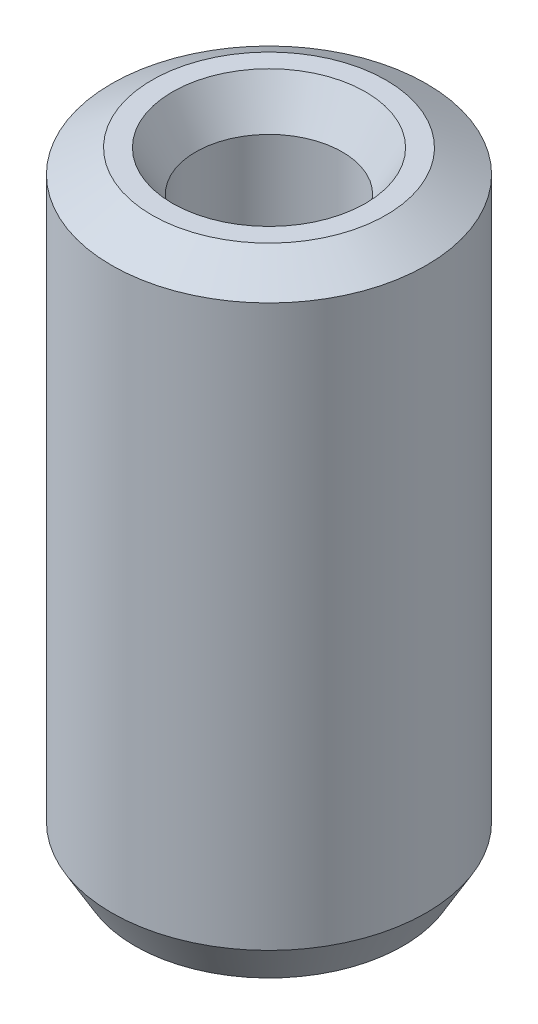
ISO-10303-21;
HEADER;
FILE_DESCRIPTION(('STEP AP214'),'2;1');
FILE_NAME('part.step','',(''),(''),'','','');
FILE_SCHEMA(('AUTOMOTIVE_DESIGN { 1 0 10303 214 1 1 1 1 }'));
ENDSEC;
DATA;
#1=APPLICATION_CONTEXT('core data for automotive mechanical design processes');
#2=APPLICATION_PROTOCOL_DEFINITION('international standard','automotive_design',2000,#1);
#3=PRODUCT_CONTEXT('',#1,'mechanical');
#4=PRODUCT('Part','Part','',(#3));
#5=PRODUCT_RELATED_PRODUCT_CATEGORY('part','',(#4));
#6=PRODUCT_DEFINITION_FORMATION('','',#4);
#7=PRODUCT_DEFINITION_CONTEXT('part definition',#1,'design');
#8=PRODUCT_DEFINITION('design','',#6,#7);
#9=PRODUCT_DEFINITION_SHAPE('','',#8);
#10=(LENGTH_UNIT() NAMED_UNIT(*) SI_UNIT(.MILLI.,.METRE.));
#11=(NAMED_UNIT(*) PLANE_ANGLE_UNIT() SI_UNIT($,.RADIAN.));
#12=(NAMED_UNIT(*) SI_UNIT($,.STERADIAN.) SOLID_ANGLE_UNIT());
#13=UNCERTAINTY_MEASURE_WITH_UNIT(LENGTH_MEASURE(1.E-05),#10,'distance_accuracy_value','');
#14=(GEOMETRIC_REPRESENTATION_CONTEXT(3) GLOBAL_UNCERTAINTY_ASSIGNED_CONTEXT((#13)) GLOBAL_UNIT_ASSIGNED_CONTEXT((#10,
#11,#12)) REPRESENTATION_CONTEXT('',''));
#15=CARTESIAN_POINT('',(0.,0.,0.));
#16=DIRECTION('',(0.,0.,1.));
#17=DIRECTION('',(1.,0.,0.));
#18=AXIS2_PLACEMENT_3D('',#15,#16,#17);
#19=CARTESIAN_POINT('',(0.,19.8357266304487,0.));
#20=DIRECTION('',(0.,-1.,0.));
#21=DIRECTION('',(0.,0.,-1.));
#22=AXIS2_PLACEMENT_3D('',#19,#20,#21);
#23=CYLINDRICAL_SURFACE('',#22,5.);
#24=CARTESIAN_POINT('',(0.,1.28205387955966,0.));
#25=DIRECTION('',(0.,1.,0.));
#26=DIRECTION('',(0.,0.,1.));
#27=AXIS2_PLACEMENT_3D('',#24,#25,#26);
#28=CIRCLE('',#27,5.);
#29=CARTESIAN_POINT('',(0.,1.28205387955966,5.));
#30=VERTEX_POINT('',#29);
#31=EDGE_CURVE('E10',#30,#30,#28,.T.);
#32=ORIENTED_EDGE('',*,*,#31,.T.);
#33=EDGE_LOOP('',(#32));
#34=FACE_BOUND('',#33,.T.);
#35=CARTESIAN_POINT('',(0.,19.0955324779693,0.));
#36=DIRECTION('',(0.,1.,0.));
#37=DIRECTION('',(0.,0.,1.));
#38=AXIS2_PLACEMENT_3D('',#35,#36,#37);
#39=CIRCLE('',#38,5.);
#40=CARTESIAN_POINT('',(0.,19.0955324779693,5.));
#41=VERTEX_POINT('',#40);
#42=EDGE_CURVE('E50',#41,#41,#39,.F.);
#43=ORIENTED_EDGE('',*,*,#42,.T.);
#44=EDGE_LOOP('',(#43));
#45=FACE_BOUND('',#44,.T.);
#46=ADVANCED_FACE('F39',(#34,#45),#23,.T.);
#47=CARTESIAN_POINT('',(0.,19.8357266304487,0.));
#48=DIRECTION('',(0.,1.,0.));
#49=DIRECTION('',(0.,0.,1.));
#50=AXIS2_PLACEMENT_3D('',#47,#48,#49);
#51=PLANE('',#50);
#52=CARTESIAN_POINT('',(0.,19.8357266304487,0.));
#53=DIRECTION('',(0.,1.,0.));
#54=DIRECTION('',(0.,0.,1.));
#55=AXIS2_PLACEMENT_3D('',#52,#53,#54);
#56=CIRCLE('',#55,3.0685033897795);
#57=CARTESIAN_POINT('',(0.,19.8357266304487,3.0685033897795));
#58=VERTEX_POINT('',#57);
#59=EDGE_CURVE('E58',#58,#58,#56,.F.);
#60=ORIENTED_EDGE('',*,*,#59,.T.);
#61=EDGE_LOOP('',(#60));
#62=FACE_BOUND('',#61,.T.);
#63=CARTESIAN_POINT('',(0.,19.8357266304487,0.));
#64=DIRECTION('',(0.,1.,0.));
#65=DIRECTION('',(0.,0.,1.));
#66=AXIS2_PLACEMENT_3D('',#63,#64,#65);
#67=CIRCLE('',#66,3.71794612044034);
#68=CARTESIAN_POINT('',(0.,19.8357266304487,3.71794612044034));
#69=VERTEX_POINT('',#68);
#70=EDGE_CURVE('E61',#69,#69,#67,.T.);
#71=ORIENTED_EDGE('',*,*,#70,.T.);
#72=EDGE_LOOP('',(#71));
#73=FACE_BOUND('',#72,.T.);
#74=ADVANCED_FACE('F88',(#62,#73),#51,.T.);
#75=CARTESIAN_POINT('',(0.,0.,0.));
#76=DIRECTION('',(0.,1.,0.));
#77=DIRECTION('',(0.,0.,1.));
#78=AXIS2_PLACEMENT_3D('',#75,#76,#77);
#79=PLANE('',#78);
#80=CARTESIAN_POINT('',(0.,0.,0.));
#81=DIRECTION('',(0.,1.,0.));
#82=DIRECTION('',(0.,0.,1.));
#83=AXIS2_PLACEMENT_3D('',#80,#81,#82);
#84=CIRCLE('',#83,3.61036311685977);
#85=CARTESIAN_POINT('',(0.,0.,3.61036311685977));
#86=VERTEX_POINT('',#85);
#87=EDGE_CURVE('E51',#86,#86,#84,.T.);
#88=ORIENTED_EDGE('',*,*,#87,.T.);
#89=EDGE_LOOP('',(#88));
#90=FACE_BOUND('',#89,.T.);
#91=CARTESIAN_POINT('',(0.,0.,0.));
#92=DIRECTION('',(0.,1.,0.));
#93=DIRECTION('',(0.,0.,1.));
#94=AXIS2_PLACEMENT_3D('',#91,#92,#93);
#95=CIRCLE('',#94,4.25980584752062);
#96=CARTESIAN_POINT('',(0.,0.,4.25980584752062));
#97=VERTEX_POINT('',#96);
#98=EDGE_CURVE('E54',#97,#97,#95,.F.);
#99=ORIENTED_EDGE('',*,*,#98,.T.);
#100=EDGE_LOOP('',(#99));
#101=FACE_BOUND('',#100,.T.);
#102=ADVANCED_FACE('F83',(#90,#101),#79,.F.);
#103=CARTESIAN_POINT('',(0.,19.8357266304487,0.));
#104=DIRECTION('',(0.,-1.,0.));
#105=DIRECTION('',(0.,0.,-1.));
#106=AXIS2_PLACEMENT_3D('',#103,#104,#105);
#107=CYLINDRICAL_SURFACE('',#106,2.32830923730011);
#108=CARTESIAN_POINT('',(0.,18.553672750889,0.));
#109=DIRECTION('',(0.,1.,0.));
#110=DIRECTION('',(0.,0.,1.));
#111=AXIS2_PLACEMENT_3D('',#108,#109,#110);
#112=CIRCLE('',#111,2.32830923730011);
#113=CARTESIAN_POINT('',(0.,18.553672750889,2.32830923730011));
#114=VERTEX_POINT('',#113);
#115=EDGE_CURVE('E67',#114,#114,#112,.T.);
#116=ORIENTED_EDGE('',*,*,#115,.T.);
#117=EDGE_LOOP('',(#116));
#118=FACE_BOUND('',#117,.T.);
#119=CARTESIAN_POINT('',(0.,0.740194152479383,0.));
#120=DIRECTION('',(0.,1.,0.));
#121=DIRECTION('',(0.,0.,1.));
#122=AXIS2_PLACEMENT_3D('',#119,#120,#121);
#123=CIRCLE('',#122,2.32830923730011);
#124=CARTESIAN_POINT('',(0.,0.740194152479383,2.32830923730011));
#125=VERTEX_POINT('',#124);
#126=EDGE_CURVE('E69',#125,#125,#123,.F.);
#127=ORIENTED_EDGE('',*,*,#126,.T.);
#128=EDGE_LOOP('',(#127));
#129=FACE_BOUND('',#128,.T.);
#130=ADVANCED_FACE('F71',(#118,#129),#107,.F.);
#131=CARTESIAN_POINT('',(0.,18.553672750889,0.));
#132=DIRECTION('',(0.,1.,0.));
#133=DIRECTION('',(0.,0.,1.));
#134=AXIS2_PLACEMENT_3D('',#131,#132,#133);
#135=CONICAL_SURFACE('',#134,2.32830923730011,0.523598775598303);
#136=ORIENTED_EDGE('',*,*,#59,.F.);
#137=EDGE_LOOP('',(#136));
#138=FACE_BOUND('',#137,.T.);
#139=ORIENTED_EDGE('',*,*,#115,.F.);
#140=EDGE_LOOP('',(#139));
#141=FACE_BOUND('',#140,.T.);
#142=ADVANCED_FACE('F77',(#138,#141),#135,.F.);
#143=CARTESIAN_POINT('',(0.,0.,0.));
#144=DIRECTION('',(0.,-1.,0.));
#145=DIRECTION('',(0.,0.,-1.));
#146=AXIS2_PLACEMENT_3D('',#143,#144,#145);
#147=CONICAL_SURFACE('',#146,3.61036311685977,1.04719755119659);
#148=ORIENTED_EDGE('',*,*,#126,.F.);
#149=EDGE_LOOP('',(#148));
#150=FACE_BOUND('',#149,.T.);
#151=ORIENTED_EDGE('',*,*,#87,.F.);
#152=EDGE_LOOP('',(#151));
#153=FACE_BOUND('',#152,.T.);
#154=ADVANCED_FACE('F73',(#150,#153),#147,.F.);
#155=CARTESIAN_POINT('',(0.,1.28205387955966,0.));
#156=DIRECTION('',(0.,1.,0.));
#157=DIRECTION('',(0.,0.,1.));
#158=AXIS2_PLACEMENT_3D('',#155,#156,#157);
#159=CONICAL_SURFACE('',#158,5.,0.523598775598302);
#160=ORIENTED_EDGE('',*,*,#98,.F.);
#161=EDGE_LOOP('',(#160));
#162=FACE_BOUND('',#161,.T.);
#163=ORIENTED_EDGE('',*,*,#31,.F.);
#164=EDGE_LOOP('',(#163));
#165=FACE_BOUND('',#164,.T.);
#166=ADVANCED_FACE('F76',(#162,#165),#159,.T.);
#167=CARTESIAN_POINT('',(0.,19.8357266304487,0.));
#168=DIRECTION('',(0.,-1.,0.));
#169=DIRECTION('',(0.,0.,-1.));
#170=AXIS2_PLACEMENT_3D('',#167,#168,#169);
#171=CONICAL_SURFACE('',#170,3.71794612044034,1.04719755119659);
#172=ORIENTED_EDGE('',*,*,#42,.F.);
#173=EDGE_LOOP('',(#172));
#174=FACE_BOUND('',#173,.T.);
#175=ORIENTED_EDGE('',*,*,#70,.F.);
#176=EDGE_LOOP('',(#175));
#177=FACE_BOUND('',#176,.T.);
#178=ADVANCED_FACE('F45',(#174,#177),#171,.T.);
#179=CLOSED_SHELL('',(#46,#74,#102,#130,#142,#154,#166,#178));
#180=MANIFOLD_SOLID_BREP('B2',#179);
#181=ADVANCED_BREP_SHAPE_REPRESENTATION('',(#18,#180),#14);
#182=SHAPE_DEFINITION_REPRESENTATION(#9,#181);
ENDSEC;
END-ISO-10303-21;
